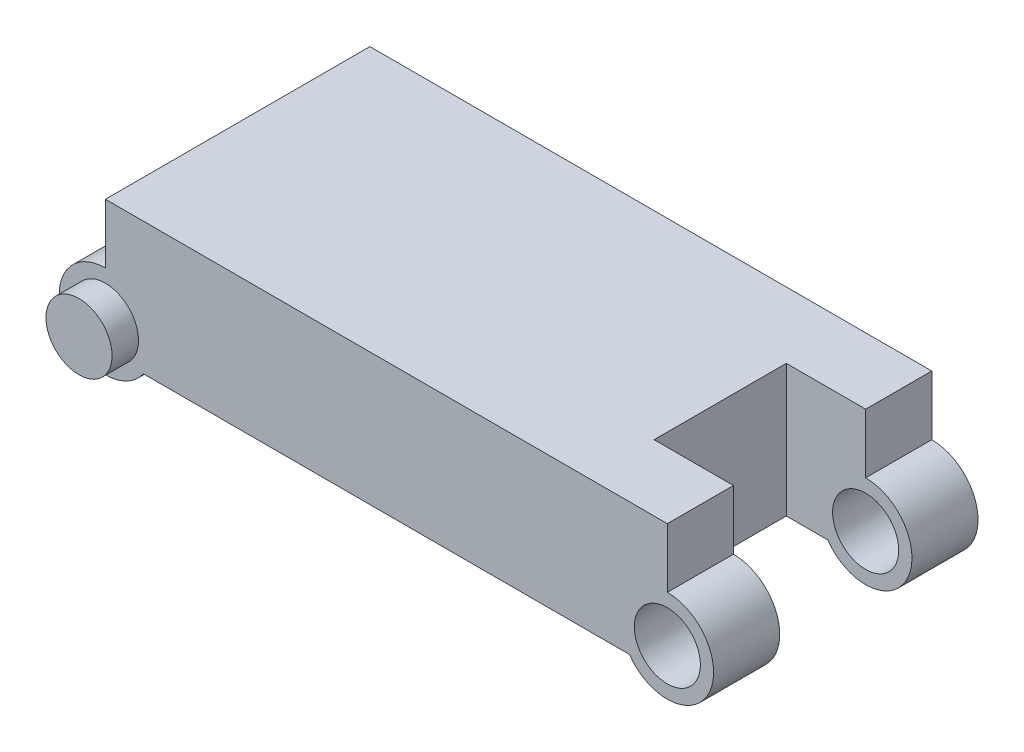
ISO-10303-21;
HEADER;
FILE_DESCRIPTION(('STEP AP214'),'2;1');
FILE_NAME('part.step','',(''),(''),'','','');
FILE_SCHEMA(('AUTOMOTIVE_DESIGN { 1 0 10303 214 1 1 1 1 }'));
ENDSEC;
DATA;
#1=APPLICATION_CONTEXT('core data for automotive mechanical design processes');
#2=APPLICATION_PROTOCOL_DEFINITION('international standard','automotive_design',2000,#1);
#3=PRODUCT_CONTEXT('',#1,'mechanical');
#4=PRODUCT('Part','Part','',(#3));
#5=PRODUCT_RELATED_PRODUCT_CATEGORY('part','',(#4));
#6=PRODUCT_DEFINITION_FORMATION('','',#4);
#7=PRODUCT_DEFINITION_CONTEXT('part definition',#1,'design');
#8=PRODUCT_DEFINITION('design','',#6,#7);
#9=PRODUCT_DEFINITION_SHAPE('','',#8);
#10=(LENGTH_UNIT() NAMED_UNIT(*) SI_UNIT(.MILLI.,.METRE.));
#11=(NAMED_UNIT(*) PLANE_ANGLE_UNIT() SI_UNIT($,.RADIAN.));
#12=(NAMED_UNIT(*) SI_UNIT($,.STERADIAN.) SOLID_ANGLE_UNIT());
#13=UNCERTAINTY_MEASURE_WITH_UNIT(LENGTH_MEASURE(1.E-05),#10,'distance_accuracy_value','');
#14=(GEOMETRIC_REPRESENTATION_CONTEXT(3) GLOBAL_UNCERTAINTY_ASSIGNED_CONTEXT((#13)) GLOBAL_UNIT_ASSIGNED_CONTEXT((#10,
#11,#12)) REPRESENTATION_CONTEXT('',''));
#15=CARTESIAN_POINT('',(0.,0.,0.));
#16=DIRECTION('',(0.,0.,1.));
#17=DIRECTION('',(1.,0.,0.));
#18=AXIS2_PLACEMENT_3D('',#15,#16,#17);
#19=CARTESIAN_POINT('',(425.,0.,200.));
#20=DIRECTION('',(0.,0.,-1.));
#21=DIRECTION('',(-1.,0.,0.));
#22=AXIS2_PLACEMENT_3D('',#19,#20,#21);
#23=CYLINDRICAL_SURFACE('',#22,35.);
#24=CARTESIAN_POINT('',(425.,0.,50.));
#25=DIRECTION('',(0.,0.,1.));
#26=DIRECTION('',(1.,0.,0.));
#27=AXIS2_PLACEMENT_3D('',#24,#25,#26);
#28=CIRCLE('',#27,35.);
#29=CARTESIAN_POINT('',(396.27718676731,-20.,50.));
#30=VERTEX_POINT('',#29);
#31=CARTESIAN_POINT('',(425.,35.,50.));
#32=VERTEX_POINT('',#31);
#33=EDGE_CURVE('E207',#30,#32,#28,.T.);
#34=ORIENTED_EDGE('',*,*,#33,.F.);
#35=DIRECTION('',(0.,0.,-1.));
#36=VECTOR('',#35,1.);
#37=CARTESIAN_POINT('',(396.27718676731,-20.,200.));
#38=LINE('',#37,#36);
#39=CARTESIAN_POINT('',(396.27718676731,-20.,0.));
#40=VERTEX_POINT('',#39);
#41=EDGE_CURVE('E98',#30,#40,#38,.T.);
#42=ORIENTED_EDGE('',*,*,#41,.T.);
#43=CARTESIAN_POINT('',(425.,0.,0.));
#44=DIRECTION('',(0.,0.,1.));
#45=DIRECTION('',(1.,0.,0.));
#46=AXIS2_PLACEMENT_3D('',#43,#44,#45);
#47=CIRCLE('',#46,35.);
#48=CARTESIAN_POINT('',(425.,35.,0.));
#49=VERTEX_POINT('',#48);
#50=EDGE_CURVE('E149',#40,#49,#47,.T.);
#51=ORIENTED_EDGE('',*,*,#50,.T.);
#52=DIRECTION('',(0.,0.,-1.));
#53=VECTOR('',#52,1.);
#54=CARTESIAN_POINT('',(425.,35.,200.));
#55=LINE('',#54,#53);
#56=EDGE_CURVE('E182',#32,#49,#55,.T.);
#57=ORIENTED_EDGE('',*,*,#56,.F.);
#58=EDGE_LOOP('',(#34,#42,#51,#57));
#59=FACE_BOUND('',#58,.T.);
#60=ADVANCED_FACE('F45',(#59),#23,.T.);
#61=CARTESIAN_POINT('',(425.,35.,200.));
#62=DIRECTION('',(-1.,0.,0.));
#63=DIRECTION('',(0.,0.,1.));
#64=AXIS2_PLACEMENT_3D('',#61,#62,#63);
#65=PLANE('',#64);
#66=DIRECTION('',(0.,1.,0.));
#67=VECTOR('',#66,1.);
#68=CARTESIAN_POINT('',(425.,35.,50.));
#69=LINE('',#68,#67);
#70=CARTESIAN_POINT('',(425.,80.,50.));
#71=VERTEX_POINT('',#70);
#72=EDGE_CURVE('E219',#32,#71,#69,.T.);
#73=ORIENTED_EDGE('',*,*,#72,.F.);
#74=ORIENTED_EDGE('',*,*,#56,.T.);
#75=DIRECTION('',(0.,1.,0.));
#76=VECTOR('',#75,1.);
#77=CARTESIAN_POINT('',(425.,35.,0.));
#78=LINE('',#77,#76);
#79=CARTESIAN_POINT('',(425.,80.,0.));
#80=VERTEX_POINT('',#79);
#81=EDGE_CURVE('E152',#49,#80,#78,.T.);
#82=ORIENTED_EDGE('',*,*,#81,.T.);
#83=DIRECTION('',(0.,0.,-1.));
#84=VECTOR('',#83,1.);
#85=CARTESIAN_POINT('',(425.,80.,200.));
#86=LINE('',#85,#84);
#87=EDGE_CURVE('E177',#71,#80,#86,.T.);
#88=ORIENTED_EDGE('',*,*,#87,.F.);
#89=EDGE_LOOP('',(#73,#74,#82,#88));
#90=FACE_BOUND('',#89,.T.);
#91=ADVANCED_FACE('F281',(#90),#65,.F.);
#92=CARTESIAN_POINT('',(0.,80.,200.));
#93=DIRECTION('',(0.,-1.,0.));
#94=DIRECTION('',(0.,0.,-1.));
#95=AXIS2_PLACEMENT_3D('',#92,#93,#94);
#96=PLANE('',#95);
#97=DIRECTION('',(-1.,0.,0.));
#98=VECTOR('',#97,1.);
#99=CARTESIAN_POINT('',(365.,80.,50.));
#100=LINE('',#99,#98);
#101=CARTESIAN_POINT('',(365.,80.,50.));
#102=VERTEX_POINT('',#101);
#103=EDGE_CURVE('E286',#71,#102,#100,.T.);
#104=ORIENTED_EDGE('',*,*,#103,.F.);
#105=ORIENTED_EDGE('',*,*,#87,.T.);
#106=DIRECTION('',(-1.,0.,0.));
#107=VECTOR('',#106,1.);
#108=CARTESIAN_POINT('',(0.,80.,0.));
#109=LINE('',#108,#107);
#110=CARTESIAN_POINT('',(0.,80.,0.));
#111=VERTEX_POINT('',#110);
#112=EDGE_CURVE('E157',#80,#111,#109,.T.);
#113=ORIENTED_EDGE('',*,*,#112,.T.);
#114=DIRECTION('',(0.,0.,-1.));
#115=VECTOR('',#114,1.);
#116=CARTESIAN_POINT('',(0.,80.,200.));
#117=LINE('',#116,#115);
#118=CARTESIAN_POINT('',(0.,80.,200.));
#119=VERTEX_POINT('',#118);
#120=EDGE_CURVE('E138',#119,#111,#117,.T.);
#121=ORIENTED_EDGE('',*,*,#120,.F.);
#122=DIRECTION('',(-1.,0.,0.));
#123=VECTOR('',#122,1.);
#124=CARTESIAN_POINT('',(0.,80.,200.));
#125=LINE('',#124,#123);
#126=CARTESIAN_POINT('',(425.,80.,200.));
#127=VERTEX_POINT('',#126);
#128=EDGE_CURVE('E124',#127,#119,#125,.T.);
#129=ORIENTED_EDGE('',*,*,#128,.F.);
#130=CARTESIAN_POINT('',(425.,80.,150.));
#131=VERTEX_POINT('',#130);
#132=EDGE_CURVE('E178',#127,#131,#86,.T.);
#133=ORIENTED_EDGE('',*,*,#132,.T.);
#134=DIRECTION('',(-1.,0.,0.));
#135=VECTOR('',#134,1.);
#136=CARTESIAN_POINT('',(365.,80.,150.));
#137=LINE('',#136,#135);
#138=CARTESIAN_POINT('',(365.,80.,150.));
#139=VERTEX_POINT('',#138);
#140=EDGE_CURVE('E296',#131,#139,#137,.T.);
#141=ORIENTED_EDGE('',*,*,#140,.T.);
#142=DIRECTION('',(0.,0.,1.));
#143=VECTOR('',#142,1.);
#144=CARTESIAN_POINT('',(365.,80.,50.));
#145=LINE('',#144,#143);
#146=EDGE_CURVE('E196',#102,#139,#145,.T.);
#147=ORIENTED_EDGE('',*,*,#146,.F.);
#148=EDGE_LOOP('',(#104,#105,#113,#121,#129,#133,#141,#147));
#149=FACE_BOUND('',#148,.T.);
#150=ADVANCED_FACE('F249',(#149),#96,.F.);
#151=CARTESIAN_POINT('',(28.7228132326901,-20.,200.));
#152=DIRECTION('',(0.,1.,0.));
#153=DIRECTION('',(-1.,0.,0.));
#154=AXIS2_PLACEMENT_3D('',#151,#152,#153);
#155=PLANE('',#154);
#156=DIRECTION('',(1.,0.,0.));
#157=VECTOR('',#156,1.);
#158=CARTESIAN_POINT('',(28.7228132326901,-20.,50.));
#159=LINE('',#158,#157);
#160=CARTESIAN_POINT('',(365.,-20.,50.));
#161=VERTEX_POINT('',#160);
#162=EDGE_CURVE('E200',#161,#30,#159,.T.);
#163=ORIENTED_EDGE('',*,*,#162,.F.);
#164=DIRECTION('',(0.,0.,1.));
#165=VECTOR('',#164,1.);
#166=CARTESIAN_POINT('',(365.,-20.,200.));
#167=LINE('',#166,#165);
#168=CARTESIAN_POINT('',(365.,-20.,150.));
#169=VERTEX_POINT('',#168);
#170=EDGE_CURVE('E11',#161,#169,#167,.T.);
#171=ORIENTED_EDGE('',*,*,#170,.T.);
#172=DIRECTION('',(1.,0.,0.));
#173=VECTOR('',#172,1.);
#174=CARTESIAN_POINT('',(28.7228132326901,-20.,150.));
#175=LINE('',#174,#173);
#176=CARTESIAN_POINT('',(396.27718676731,-20.,150.));
#177=VERTEX_POINT('',#176);
#178=EDGE_CURVE('E195',#169,#177,#175,.T.);
#179=ORIENTED_EDGE('',*,*,#178,.T.);
#180=CARTESIAN_POINT('',(396.27718676731,-20.,200.));
#181=VERTEX_POINT('',#180);
#182=EDGE_CURVE('E169',#181,#177,#38,.T.);
#183=ORIENTED_EDGE('',*,*,#182,.F.);
#184=DIRECTION('',(1.,0.,0.));
#185=VECTOR('',#184,1.);
#186=CARTESIAN_POINT('',(28.7228132326901,-20.,200.));
#187=LINE('',#186,#185);
#188=CARTESIAN_POINT('',(28.7228132326901,-20.,200.));
#189=VERTEX_POINT('',#188);
#190=EDGE_CURVE('E70',#189,#181,#187,.T.);
#191=ORIENTED_EDGE('',*,*,#190,.F.);
#192=DIRECTION('',(0.,0.,-1.));
#193=VECTOR('',#192,1.);
#194=CARTESIAN_POINT('',(28.7228132326901,-20.,200.));
#195=LINE('',#194,#193);
#196=CARTESIAN_POINT('',(28.7228132326901,-20.,0.));
#197=VERTEX_POINT('',#196);
#198=EDGE_CURVE('E139',#189,#197,#195,.T.);
#199=ORIENTED_EDGE('',*,*,#198,.T.);
#200=DIRECTION('',(1.,0.,0.));
#201=VECTOR('',#200,1.);
#202=CARTESIAN_POINT('',(28.7228132326901,-20.,0.));
#203=LINE('',#202,#201);
#204=EDGE_CURVE('E165',#197,#40,#203,.T.);
#205=ORIENTED_EDGE('',*,*,#204,.T.);
#206=ORIENTED_EDGE('',*,*,#41,.F.);
#207=EDGE_LOOP('',(#163,#171,#179,#183,#191,#199,#205,#206));
#208=FACE_BOUND('',#207,.T.);
#209=ADVANCED_FACE('F259',(#208),#155,.F.);
#210=CARTESIAN_POINT('',(425.,0.,200.));
#211=DIRECTION('',(0.,0.,-1.));
#212=DIRECTION('',(-1.,0.,0.));
#213=AXIS2_PLACEMENT_3D('',#210,#211,#212);
#214=CYLINDRICAL_SURFACE('',#213,25.);
#215=CARTESIAN_POINT('',(425.,0.,0.));
#216=DIRECTION('',(0.,0.,1.));
#217=DIRECTION('',(1.,0.,0.));
#218=AXIS2_PLACEMENT_3D('',#215,#216,#217);
#219=CIRCLE('',#218,25.);
#220=CARTESIAN_POINT('',(450.,0.,0.));
#221=VERTEX_POINT('',#220);
#222=EDGE_CURVE('E190',#221,#221,#219,.T.);
#223=ORIENTED_EDGE('',*,*,#222,.F.);
#224=EDGE_LOOP('',(#223));
#225=FACE_BOUND('',#224,.T.);
#226=CARTESIAN_POINT('',(425.,0.,50.));
#227=DIRECTION('',(0.,0.,1.));
#228=DIRECTION('',(1.,0.,0.));
#229=AXIS2_PLACEMENT_3D('',#226,#227,#228);
#230=CIRCLE('',#229,25.);
#231=CARTESIAN_POINT('',(450.,0.,50.));
#232=VERTEX_POINT('',#231);
#233=EDGE_CURVE('E197',#232,#232,#230,.T.);
#234=ORIENTED_EDGE('',*,*,#233,.T.);
#235=EDGE_LOOP('',(#234));
#236=FACE_BOUND('',#235,.T.);
#237=ADVANCED_FACE('F342',(#225,#236),#214,.F.);
#238=CARTESIAN_POINT('',(425.,0.,200.));
#239=DIRECTION('',(0.,0.,1.));
#240=DIRECTION('',(1.,0.,0.));
#241=AXIS2_PLACEMENT_3D('',#238,#239,#240);
#242=PLANE('',#241);
#243=CARTESIAN_POINT('',(0.,0.,200.));
#244=DIRECTION('',(0.,0.,1.));
#245=DIRECTION('',(1.,0.,0.));
#246=AXIS2_PLACEMENT_3D('',#243,#244,#245);
#247=CIRCLE('',#246,25.);
#248=CARTESIAN_POINT('',(25.,0.,200.));
#249=VERTEX_POINT('',#248);
#250=EDGE_CURVE('E54',#249,#249,#247,.T.);
#251=ORIENTED_EDGE('',*,*,#250,.F.);
#252=EDGE_LOOP('',(#251));
#253=FACE_BOUND('',#252,.T.);
#254=CARTESIAN_POINT('',(425.,0.,200.));
#255=DIRECTION('',(0.,0.,1.));
#256=DIRECTION('',(1.,0.,0.));
#257=AXIS2_PLACEMENT_3D('',#254,#255,#256);
#258=CIRCLE('',#257,35.);
#259=CARTESIAN_POINT('',(425.,35.,200.));
#260=VERTEX_POINT('',#259);
#261=EDGE_CURVE('E168',#181,#260,#258,.T.);
#262=ORIENTED_EDGE('',*,*,#261,.T.);
#263=DIRECTION('',(0.,1.,0.));
#264=VECTOR('',#263,1.);
#265=CARTESIAN_POINT('',(425.,35.,200.));
#266=LINE('',#265,#264);
#267=EDGE_CURVE('E107',#260,#127,#266,.T.);
#268=ORIENTED_EDGE('',*,*,#267,.T.);
#269=ORIENTED_EDGE('',*,*,#128,.T.);
#270=DIRECTION('',(0.,-1.,0.));
#271=VECTOR('',#270,1.);
#272=CARTESIAN_POINT('',(0.,35.,200.));
#273=LINE('',#272,#271);
#274=CARTESIAN_POINT('',(0.,35.,200.));
#275=VERTEX_POINT('',#274);
#276=EDGE_CURVE('E116',#119,#275,#273,.T.);
#277=ORIENTED_EDGE('',*,*,#276,.T.);
#278=CARTESIAN_POINT('',(0.,0.,200.));
#279=DIRECTION('',(0.,0.,1.));
#280=DIRECTION('',(1.,0.,0.));
#281=AXIS2_PLACEMENT_3D('',#278,#279,#280);
#282=CIRCLE('',#281,35.);
#283=EDGE_CURVE('E121',#275,#189,#282,.T.);
#284=ORIENTED_EDGE('',*,*,#283,.T.);
#285=ORIENTED_EDGE('',*,*,#190,.T.);
#286=EDGE_LOOP('',(#262,#268,#269,#277,#284,#285));
#287=FACE_BOUND('',#286,.T.);
#288=CARTESIAN_POINT('',(425.,0.,200.));
#289=DIRECTION('',(0.,0.,1.));
#290=DIRECTION('',(1.,0.,0.));
#291=AXIS2_PLACEMENT_3D('',#288,#289,#290);
#292=CIRCLE('',#291,25.);
#293=CARTESIAN_POINT('',(450.,0.,200.));
#294=VERTEX_POINT('',#293);
#295=EDGE_CURVE('E153',#294,#294,#292,.T.);
#296=ORIENTED_EDGE('',*,*,#295,.F.);
#297=EDGE_LOOP('',(#296));
#298=FACE_BOUND('',#297,.T.);
#299=ADVANCED_FACE('F118',(#253,#287,#298),#242,.T.);
#300=CARTESIAN_POINT('',(425.,0.,0.));
#301=DIRECTION('',(0.,0.,1.));
#302=DIRECTION('',(1.,0.,0.));
#303=AXIS2_PLACEMENT_3D('',#300,#301,#302);
#304=PLANE('',#303);
#305=CARTESIAN_POINT('',(0.,0.,0.));
#306=DIRECTION('',(0.,0.,1.));
#307=DIRECTION('',(1.,0.,0.));
#308=AXIS2_PLACEMENT_3D('',#305,#306,#307);
#309=CIRCLE('',#308,25.);
#310=CARTESIAN_POINT('',(25.,0.,0.));
#311=VERTEX_POINT('',#310);
#312=EDGE_CURVE('E186',#311,#311,#309,.T.);
#313=ORIENTED_EDGE('',*,*,#312,.T.);
#314=EDGE_LOOP('',(#313));
#315=FACE_BOUND('',#314,.T.);
#316=ORIENTED_EDGE('',*,*,#50,.F.);
#317=ORIENTED_EDGE('',*,*,#204,.F.);
#318=CARTESIAN_POINT('',(0.,0.,0.));
#319=DIRECTION('',(0.,0.,1.));
#320=DIRECTION('',(1.,0.,0.));
#321=AXIS2_PLACEMENT_3D('',#318,#319,#320);
#322=CIRCLE('',#321,35.);
#323=CARTESIAN_POINT('',(0.,35.,0.));
#324=VERTEX_POINT('',#323);
#325=EDGE_CURVE('E162',#324,#197,#322,.T.);
#326=ORIENTED_EDGE('',*,*,#325,.F.);
#327=DIRECTION('',(0.,-1.,0.));
#328=VECTOR('',#327,1.);
#329=CARTESIAN_POINT('',(0.,35.,0.));
#330=LINE('',#329,#328);
#331=EDGE_CURVE('E134',#111,#324,#330,.T.);
#332=ORIENTED_EDGE('',*,*,#331,.F.);
#333=ORIENTED_EDGE('',*,*,#112,.F.);
#334=ORIENTED_EDGE('',*,*,#81,.F.);
#335=EDGE_LOOP('',(#316,#317,#326,#332,#333,#334));
#336=FACE_BOUND('',#335,.T.);
#337=ORIENTED_EDGE('',*,*,#222,.T.);
#338=EDGE_LOOP('',(#337));
#339=FACE_BOUND('',#338,.T.);
#340=ADVANCED_FACE('F253',(#315,#336,#339),#304,.F.);
#341=ORIENTED_EDGE('',*,*,#182,.T.);
#342=CARTESIAN_POINT('',(425.,0.,150.));
#343=DIRECTION('',(0.,0.,1.));
#344=DIRECTION('',(1.,0.,0.));
#345=AXIS2_PLACEMENT_3D('',#342,#343,#344);
#346=CIRCLE('',#345,35.);
#347=CARTESIAN_POINT('',(425.,35.,150.));
#348=VERTEX_POINT('',#347);
#349=EDGE_CURVE('E61',#177,#348,#346,.T.);
#350=ORIENTED_EDGE('',*,*,#349,.T.);
#351=EDGE_CURVE('E183',#260,#348,#55,.T.);
#352=ORIENTED_EDGE('',*,*,#351,.F.);
#353=ORIENTED_EDGE('',*,*,#261,.F.);
#354=EDGE_LOOP('',(#341,#350,#352,#353));
#355=FACE_BOUND('',#354,.T.);
#356=ADVANCED_FACE('F47',(#355),#23,.T.);
#357=ORIENTED_EDGE('',*,*,#351,.T.);
#358=DIRECTION('',(0.,1.,0.));
#359=VECTOR('',#358,1.);
#360=CARTESIAN_POINT('',(425.,35.,150.));
#361=LINE('',#360,#359);
#362=EDGE_CURVE('E201',#348,#131,#361,.T.);
#363=ORIENTED_EDGE('',*,*,#362,.T.);
#364=ORIENTED_EDGE('',*,*,#132,.F.);
#365=ORIENTED_EDGE('',*,*,#267,.F.);
#366=EDGE_LOOP('',(#357,#363,#364,#365));
#367=FACE_BOUND('',#366,.T.);
#368=ADVANCED_FACE('F245',(#367),#65,.F.);
#369=CARTESIAN_POINT('',(0.,35.,200.));
#370=DIRECTION('',(1.,0.,0.));
#371=DIRECTION('',(0.,0.,-1.));
#372=AXIS2_PLACEMENT_3D('',#369,#370,#371);
#373=PLANE('',#372);
#374=ORIENTED_EDGE('',*,*,#331,.T.);
#375=DIRECTION('',(0.,0.,-1.));
#376=VECTOR('',#375,1.);
#377=CARTESIAN_POINT('',(0.,35.,200.));
#378=LINE('',#377,#376);
#379=EDGE_CURVE('E131',#275,#324,#378,.T.);
#380=ORIENTED_EDGE('',*,*,#379,.F.);
#381=ORIENTED_EDGE('',*,*,#276,.F.);
#382=ORIENTED_EDGE('',*,*,#120,.T.);
#383=EDGE_LOOP('',(#374,#380,#381,#382));
#384=FACE_BOUND('',#383,.T.);
#385=ADVANCED_FACE('F132',(#384),#373,.F.);
#386=CARTESIAN_POINT('',(0.,0.,200.));
#387=DIRECTION('',(0.,0.,-1.));
#388=DIRECTION('',(-1.,0.,0.));
#389=AXIS2_PLACEMENT_3D('',#386,#387,#388);
#390=CYLINDRICAL_SURFACE('',#389,35.);
#391=ORIENTED_EDGE('',*,*,#325,.T.);
#392=ORIENTED_EDGE('',*,*,#198,.F.);
#393=ORIENTED_EDGE('',*,*,#283,.F.);
#394=ORIENTED_EDGE('',*,*,#379,.T.);
#395=EDGE_LOOP('',(#391,#392,#393,#394));
#396=FACE_BOUND('',#395,.T.);
#397=ADVANCED_FACE('F141',(#396),#390,.T.);
#398=CARTESIAN_POINT('',(425.,0.,150.));
#399=DIRECTION('',(0.,0.,1.));
#400=DIRECTION('',(1.,0.,0.));
#401=AXIS2_PLACEMENT_3D('',#398,#399,#400);
#402=CIRCLE('',#401,25.);
#403=CARTESIAN_POINT('',(450.,0.,150.));
#404=VERTEX_POINT('',#403);
#405=EDGE_CURVE('E192',#404,#404,#402,.T.);
#406=ORIENTED_EDGE('',*,*,#405,.F.);
#407=EDGE_LOOP('',(#406));
#408=FACE_BOUND('',#407,.T.);
#409=ORIENTED_EDGE('',*,*,#295,.T.);
#410=EDGE_LOOP('',(#409));
#411=FACE_BOUND('',#410,.T.);
#412=ADVANCED_FACE('F351',(#408,#411),#214,.F.);
#413=CARTESIAN_POINT('',(0.,0.,-20.));
#414=DIRECTION('',(0.,0.,1.));
#415=DIRECTION('',(1.,0.,0.));
#416=AXIS2_PLACEMENT_3D('',#413,#414,#415);
#417=PLANE('',#416);
#418=CARTESIAN_POINT('',(0.,0.,-20.));
#419=DIRECTION('',(0.,0.,1.));
#420=DIRECTION('',(1.,0.,0.));
#421=AXIS2_PLACEMENT_3D('',#418,#419,#420);
#422=CIRCLE('',#421,25.);
#423=CARTESIAN_POINT('',(25.,0.,-20.));
#424=VERTEX_POINT('',#423);
#425=EDGE_CURVE('E191',#424,#424,#422,.T.);
#426=ORIENTED_EDGE('',*,*,#425,.F.);
#427=EDGE_LOOP('',(#426));
#428=FACE_BOUND('',#427,.T.);
#429=ADVANCED_FACE('F410',(#428),#417,.F.);
#430=CARTESIAN_POINT('',(0.,0.,-20.));
#431=DIRECTION('',(0.,0.,1.));
#432=DIRECTION('',(1.,0.,0.));
#433=AXIS2_PLACEMENT_3D('',#430,#431,#432);
#434=CYLINDRICAL_SURFACE('',#433,25.);
#435=ORIENTED_EDGE('',*,*,#425,.T.);
#436=EDGE_LOOP('',(#435));
#437=FACE_BOUND('',#436,.T.);
#438=ORIENTED_EDGE('',*,*,#312,.F.);
#439=EDGE_LOOP('',(#438));
#440=FACE_BOUND('',#439,.T.);
#441=ADVANCED_FACE('F414',(#437,#440),#434,.T.);
#442=ORIENTED_EDGE('',*,*,#250,.T.);
#443=EDGE_LOOP('',(#442));
#444=FACE_BOUND('',#443,.T.);
#445=CARTESIAN_POINT('',(0.,0.,220.));
#446=DIRECTION('',(0.,0.,1.));
#447=DIRECTION('',(1.,0.,0.));
#448=AXIS2_PLACEMENT_3D('',#445,#446,#447);
#449=CIRCLE('',#448,25.);
#450=CARTESIAN_POINT('',(25.,0.,220.));
#451=VERTEX_POINT('',#450);
#452=EDGE_CURVE('E223',#451,#451,#449,.T.);
#453=ORIENTED_EDGE('',*,*,#452,.F.);
#454=EDGE_LOOP('',(#453));
#455=FACE_BOUND('',#454,.T.);
#456=ADVANCED_FACE('F322',(#444,#455),#434,.T.);
#457=CARTESIAN_POINT('',(0.,0.,220.));
#458=DIRECTION('',(0.,0.,1.));
#459=DIRECTION('',(1.,0.,0.));
#460=AXIS2_PLACEMENT_3D('',#457,#458,#459);
#461=PLANE('',#460);
#462=ORIENTED_EDGE('',*,*,#452,.T.);
#463=EDGE_LOOP('',(#462));
#464=FACE_BOUND('',#463,.T.);
#465=ADVANCED_FACE('F313',(#464),#461,.T.);
#466=CARTESIAN_POINT('',(365.,80.,50.));
#467=DIRECTION('',(-1.,0.,0.));
#468=DIRECTION('',(0.,0.,1.));
#469=AXIS2_PLACEMENT_3D('',#466,#467,#468);
#470=PLANE('',#469);
#471=DIRECTION('',(0.,-1.,0.));
#472=VECTOR('',#471,1.);
#473=CARTESIAN_POINT('',(365.,80.,50.));
#474=LINE('',#473,#472);
#475=EDGE_CURVE('E291',#102,#161,#474,.T.);
#476=ORIENTED_EDGE('',*,*,#475,.F.);
#477=ORIENTED_EDGE('',*,*,#146,.T.);
#478=DIRECTION('',(0.,-1.,0.));
#479=VECTOR('',#478,1.);
#480=CARTESIAN_POINT('',(365.,80.,150.));
#481=LINE('',#480,#479);
#482=EDGE_CURVE('E299',#139,#169,#481,.T.);
#483=ORIENTED_EDGE('',*,*,#482,.T.);
#484=ORIENTED_EDGE('',*,*,#170,.F.);
#485=EDGE_LOOP('',(#476,#477,#483,#484));
#486=FACE_BOUND('',#485,.T.);
#487=ADVANCED_FACE('F310',(#486),#470,.F.);
#488=CARTESIAN_POINT('',(0.,0.,50.));
#489=DIRECTION('',(0.,0.,1.));
#490=DIRECTION('',(1.,0.,0.));
#491=AXIS2_PLACEMENT_3D('',#488,#489,#490);
#492=PLANE('',#491);
#493=ORIENTED_EDGE('',*,*,#233,.F.);
#494=EDGE_LOOP('',(#493));
#495=FACE_BOUND('',#494,.T.);
#496=ORIENTED_EDGE('',*,*,#72,.T.);
#497=ORIENTED_EDGE('',*,*,#103,.T.);
#498=ORIENTED_EDGE('',*,*,#475,.T.);
#499=ORIENTED_EDGE('',*,*,#162,.T.);
#500=ORIENTED_EDGE('',*,*,#33,.T.);
#501=EDGE_LOOP('',(#496,#497,#498,#499,#500));
#502=FACE_BOUND('',#501,.T.);
#503=ADVANCED_FACE('F276',(#495,#502),#492,.T.);
#504=CARTESIAN_POINT('',(0.,0.,150.));
#505=DIRECTION('',(0.,0.,1.));
#506=DIRECTION('',(1.,0.,0.));
#507=AXIS2_PLACEMENT_3D('',#504,#505,#506);
#508=PLANE('',#507);
#509=ORIENTED_EDGE('',*,*,#405,.T.);
#510=EDGE_LOOP('',(#509));
#511=FACE_BOUND('',#510,.T.);
#512=ORIENTED_EDGE('',*,*,#349,.F.);
#513=ORIENTED_EDGE('',*,*,#178,.F.);
#514=ORIENTED_EDGE('',*,*,#482,.F.);
#515=ORIENTED_EDGE('',*,*,#140,.F.);
#516=ORIENTED_EDGE('',*,*,#362,.F.);
#517=EDGE_LOOP('',(#512,#513,#514,#515,#516));
#518=FACE_BOUND('',#517,.T.);
#519=ADVANCED_FACE('F308',(#511,#518),#508,.F.);
#520=CLOSED_SHELL('',(#60,#91,#150,#209,#237,#299,#340,#356,#368,#385,#397,#412,#429,#441,#456,
#465,#487,#503,#519));
#521=MANIFOLD_SOLID_BREP('B2',#520);
#522=ADVANCED_BREP_SHAPE_REPRESENTATION('',(#18,#521),#14);
#523=SHAPE_DEFINITION_REPRESENTATION(#9,#522);
ENDSEC;
END-ISO-10303-21;
